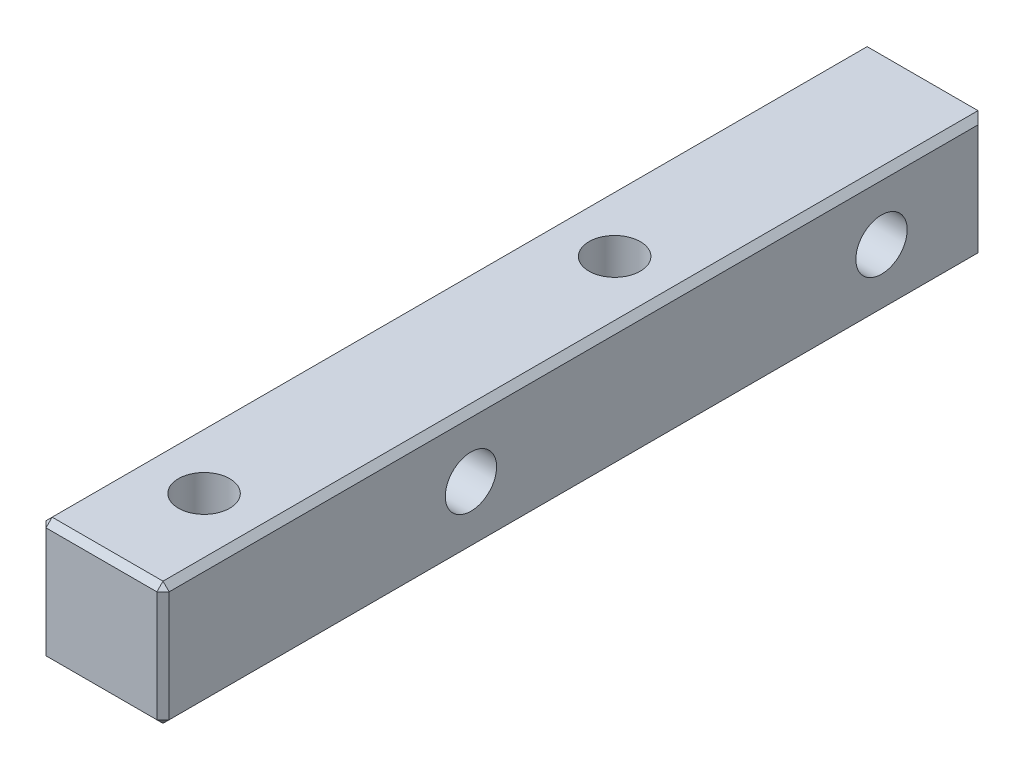
ISO-10303-21;
HEADER;
FILE_DESCRIPTION(('STEP AP214'),'2;1');
FILE_NAME('part.step','',(''),(''),'','','');
FILE_SCHEMA(('AUTOMOTIVE_DESIGN { 1 0 10303 214 1 1 1 1 }'));
ENDSEC;
DATA;
#1=APPLICATION_CONTEXT('core data for automotive mechanical design processes');
#2=APPLICATION_PROTOCOL_DEFINITION('international standard','automotive_design',2000,#1);
#3=PRODUCT_CONTEXT('',#1,'mechanical');
#4=PRODUCT('Part','Part','',(#3));
#5=PRODUCT_RELATED_PRODUCT_CATEGORY('part','',(#4));
#6=PRODUCT_DEFINITION_FORMATION('','',#4);
#7=PRODUCT_DEFINITION_CONTEXT('part definition',#1,'design');
#8=PRODUCT_DEFINITION('design','',#6,#7);
#9=PRODUCT_DEFINITION_SHAPE('','',#8);
#10=(LENGTH_UNIT() NAMED_UNIT(*) SI_UNIT(.MILLI.,.METRE.));
#11=(NAMED_UNIT(*) PLANE_ANGLE_UNIT() SI_UNIT($,.RADIAN.));
#12=(NAMED_UNIT(*) SI_UNIT($,.STERADIAN.) SOLID_ANGLE_UNIT());
#13=UNCERTAINTY_MEASURE_WITH_UNIT(LENGTH_MEASURE(1.E-05),#10,'distance_accuracy_value','');
#14=(GEOMETRIC_REPRESENTATION_CONTEXT(3) GLOBAL_UNCERTAINTY_ASSIGNED_CONTEXT((#13)) GLOBAL_UNIT_ASSIGNED_CONTEXT((#10,
#11,#12)) REPRESENTATION_CONTEXT('',''));
#15=CARTESIAN_POINT('',(0.,0.,0.));
#16=DIRECTION('',(0.,0.,1.));
#17=DIRECTION('',(1.,0.,0.));
#18=AXIS2_PLACEMENT_3D('',#15,#16,#17);
#19=CARTESIAN_POINT('',(3.,-3.,20.));
#20=DIRECTION('',(-1.,0.,0.));
#21=DIRECTION('',(0.,-1.,0.));
#22=AXIS2_PLACEMENT_3D('',#19,#20,#21);
#23=PLANE('',#22);
#24=DIRECTION('',(0.,0.,1.));
#25=VECTOR('',#24,1.);
#26=CARTESIAN_POINT('',(3.,2.7,20.));
#27=LINE('',#26,#25);
#28=CARTESIAN_POINT('',(3.,2.7,-19.7));
#29=VERTEX_POINT('',#28);
#30=CARTESIAN_POINT('',(3.,2.7,19.7));
#31=VERTEX_POINT('',#30);
#32=EDGE_CURVE('E182',#29,#31,#27,.T.);
#33=ORIENTED_EDGE('',*,*,#32,.T.);
#34=DIRECTION('',(0.,-1.,0.));
#35=VECTOR('',#34,1.);
#36=CARTESIAN_POINT('',(3.,-3.,19.7));
#37=LINE('',#36,#35);
#38=CARTESIAN_POINT('',(3.,-2.7,19.7));
#39=VERTEX_POINT('',#38);
#40=EDGE_CURVE('E188',#31,#39,#37,.T.);
#41=ORIENTED_EDGE('',*,*,#40,.T.);
#42=DIRECTION('',(0.,0.,-1.));
#43=VECTOR('',#42,1.);
#44=CARTESIAN_POINT('',(3.,-2.7,20.));
#45=LINE('',#44,#43);
#46=CARTESIAN_POINT('',(3.,-2.7,-19.7));
#47=VERTEX_POINT('',#46);
#48=EDGE_CURVE('E186',#39,#47,#45,.T.);
#49=ORIENTED_EDGE('',*,*,#48,.T.);
#50=DIRECTION('',(0.,1.,0.));
#51=VECTOR('',#50,1.);
#52=CARTESIAN_POINT('',(3.,3.,-19.7));
#53=LINE('',#52,#51);
#54=EDGE_CURVE('E184',#47,#29,#53,.T.);
#55=ORIENTED_EDGE('',*,*,#54,.T.);
#56=EDGE_LOOP('',(#33,#41,#49,#55));
#57=FACE_BOUND('',#56,.T.);
#58=CARTESIAN_POINT('',(3.,0.,-15.));
#59=DIRECTION('',(-1.,0.,0.));
#60=DIRECTION('',(0.,-1.,0.));
#61=AXIS2_PLACEMENT_3D('',#58,#59,#60);
#62=CIRCLE('',#61,1.24999999999999);
#63=CARTESIAN_POINT('',(3.,-1.24999999999999,-15.));
#64=VERTEX_POINT('',#63);
#65=EDGE_CURVE('E266',#64,#64,#62,.T.);
#66=ORIENTED_EDGE('',*,*,#65,.T.);
#67=EDGE_LOOP('',(#66));
#68=FACE_BOUND('',#67,.T.);
#69=CARTESIAN_POINT('',(3.,0.,5.));
#70=DIRECTION('',(-1.,0.,0.));
#71=DIRECTION('',(0.,-1.,0.));
#72=AXIS2_PLACEMENT_3D('',#69,#70,#71);
#73=CIRCLE('',#72,1.24999999999999);
#74=CARTESIAN_POINT('',(3.,-1.24999999999999,5.));
#75=VERTEX_POINT('',#74);
#76=EDGE_CURVE('E272',#75,#75,#73,.T.);
#77=ORIENTED_EDGE('',*,*,#76,.T.);
#78=EDGE_LOOP('',(#77));
#79=FACE_BOUND('',#78,.T.);
#80=ADVANCED_FACE('F42',(#57,#68,#79),#23,.F.);
#81=CARTESIAN_POINT('',(-3.,3.,20.));
#82=DIRECTION('',(0.,-1.,0.));
#83=DIRECTION('',(1.,0.,0.));
#84=AXIS2_PLACEMENT_3D('',#81,#82,#83);
#85=PLANE('',#84);
#86=CARTESIAN_POINT('',(0.,3.,-5.));
#87=DIRECTION('',(0.,1.,0.));
#88=DIRECTION('',(0.,0.,1.));
#89=AXIS2_PLACEMENT_3D('',#86,#87,#88);
#90=CIRCLE('',#89,1.24999999999999);
#91=CARTESIAN_POINT('',(0.,3.,-3.75000000000001));
#92=VERTEX_POINT('',#91);
#93=EDGE_CURVE('E244',#92,#92,#90,.T.);
#94=ORIENTED_EDGE('',*,*,#93,.F.);
#95=EDGE_LOOP('',(#94));
#96=FACE_BOUND('',#95,.T.);
#97=CARTESIAN_POINT('',(0.,3.,15.));
#98=DIRECTION('',(0.,1.,0.));
#99=DIRECTION('',(0.,0.,1.));
#100=AXIS2_PLACEMENT_3D('',#97,#98,#99);
#101=CIRCLE('',#100,1.24999999999999);
#102=CARTESIAN_POINT('',(0.,3.,16.25));
#103=VERTEX_POINT('',#102);
#104=EDGE_CURVE('E255',#103,#103,#101,.T.);
#105=ORIENTED_EDGE('',*,*,#104,.F.);
#106=EDGE_LOOP('',(#105));
#107=FACE_BOUND('',#106,.T.);
#108=DIRECTION('',(1.,0.,0.));
#109=VECTOR('',#108,1.);
#110=CARTESIAN_POINT('',(-3.,3.,19.7));
#111=LINE('',#110,#109);
#112=CARTESIAN_POINT('',(-2.7,3.,19.7));
#113=VERTEX_POINT('',#112);
#114=CARTESIAN_POINT('',(2.7,3.,19.7));
#115=VERTEX_POINT('',#114);
#116=EDGE_CURVE('E52',#113,#115,#111,.T.);
#117=ORIENTED_EDGE('',*,*,#116,.T.);
#118=DIRECTION('',(0.,0.,-1.));
#119=VECTOR('',#118,1.);
#120=CARTESIAN_POINT('',(2.7,3.,20.));
#121=LINE('',#120,#119);
#122=CARTESIAN_POINT('',(2.7,3.,-20.));
#123=VERTEX_POINT('',#122);
#124=EDGE_CURVE('E11',#115,#123,#121,.T.);
#125=ORIENTED_EDGE('',*,*,#124,.T.);
#126=DIRECTION('',(-1.,0.,0.));
#127=VECTOR('',#126,1.);
#128=CARTESIAN_POINT('',(-3.,3.,-20.));
#129=LINE('',#128,#127);
#130=CARTESIAN_POINT('',(-2.7,3.,-20.));
#131=VERTEX_POINT('',#130);
#132=EDGE_CURVE('E155',#123,#131,#129,.T.);
#133=ORIENTED_EDGE('',*,*,#132,.T.);
#134=DIRECTION('',(0.,0.,1.));
#135=VECTOR('',#134,1.);
#136=CARTESIAN_POINT('',(-2.7,3.,20.));
#137=LINE('',#136,#135);
#138=EDGE_CURVE('E63',#131,#113,#137,.T.);
#139=ORIENTED_EDGE('',*,*,#138,.T.);
#140=EDGE_LOOP('',(#117,#125,#133,#139));
#141=FACE_BOUND('',#140,.T.);
#142=ADVANCED_FACE('F276',(#96,#107,#141),#85,.F.);
#143=CARTESIAN_POINT('',(-3.,-3.,20.));
#144=DIRECTION('',(1.,0.,0.));
#145=DIRECTION('',(0.,0.,-1.));
#146=AXIS2_PLACEMENT_3D('',#143,#144,#145);
#147=PLANE('',#146);
#148=DIRECTION('',(0.,-1.,0.));
#149=VECTOR('',#148,1.);
#150=CARTESIAN_POINT('',(-3.,-3.,-19.7));
#151=LINE('',#150,#149);
#152=CARTESIAN_POINT('',(-3.,2.7,-19.7));
#153=VERTEX_POINT('',#152);
#154=CARTESIAN_POINT('',(-3.,-2.7,-19.7));
#155=VERTEX_POINT('',#154);
#156=EDGE_CURVE('E170',#153,#155,#151,.T.);
#157=ORIENTED_EDGE('',*,*,#156,.T.);
#158=DIRECTION('',(0.,0.,1.));
#159=VECTOR('',#158,1.);
#160=CARTESIAN_POINT('',(-3.,-2.7,20.));
#161=LINE('',#160,#159);
#162=CARTESIAN_POINT('',(-3.,-2.7,19.7));
#163=VERTEX_POINT('',#162);
#164=EDGE_CURVE('E132',#155,#163,#161,.T.);
#165=ORIENTED_EDGE('',*,*,#164,.T.);
#166=DIRECTION('',(0.,1.,0.));
#167=VECTOR('',#166,1.);
#168=CARTESIAN_POINT('',(-3.,-3.,19.7));
#169=LINE('',#168,#167);
#170=CARTESIAN_POINT('',(-3.,2.7,19.7));
#171=VERTEX_POINT('',#170);
#172=EDGE_CURVE('E168',#163,#171,#169,.T.);
#173=ORIENTED_EDGE('',*,*,#172,.T.);
#174=DIRECTION('',(0.,0.,-1.));
#175=VECTOR('',#174,1.);
#176=CARTESIAN_POINT('',(-3.,2.7,20.));
#177=LINE('',#176,#175);
#178=EDGE_CURVE('E163',#171,#153,#177,.T.);
#179=ORIENTED_EDGE('',*,*,#178,.T.);
#180=EDGE_LOOP('',(#157,#165,#173,#179));
#181=FACE_BOUND('',#180,.T.);
#182=CARTESIAN_POINT('',(-3.,0.,-15.));
#183=DIRECTION('',(-1.,0.,0.));
#184=DIRECTION('',(0.,0.,1.));
#185=AXIS2_PLACEMENT_3D('',#182,#183,#184);
#186=CIRCLE('',#185,1.24999999999999);
#187=CARTESIAN_POINT('',(-3.,0.,-13.75));
#188=VERTEX_POINT('',#187);
#189=EDGE_CURVE('E263',#188,#188,#186,.T.);
#190=ORIENTED_EDGE('',*,*,#189,.F.);
#191=EDGE_LOOP('',(#190));
#192=FACE_BOUND('',#191,.T.);
#193=CARTESIAN_POINT('',(-3.,0.,5.));
#194=DIRECTION('',(-1.,0.,0.));
#195=DIRECTION('',(0.,0.,1.));
#196=AXIS2_PLACEMENT_3D('',#193,#194,#195);
#197=CIRCLE('',#196,1.24999999999999);
#198=CARTESIAN_POINT('',(-3.,0.,6.24999999999999));
#199=VERTEX_POINT('',#198);
#200=EDGE_CURVE('E269',#199,#199,#197,.T.);
#201=ORIENTED_EDGE('',*,*,#200,.F.);
#202=EDGE_LOOP('',(#201));
#203=FACE_BOUND('',#202,.T.);
#204=ADVANCED_FACE('F288',(#181,#192,#203),#147,.F.);
#205=CARTESIAN_POINT('',(-3.,-3.,20.));
#206=DIRECTION('',(0.,1.,0.));
#207=DIRECTION('',(0.,0.,1.));
#208=AXIS2_PLACEMENT_3D('',#205,#206,#207);
#209=PLANE('',#208);
#210=DIRECTION('',(0.,0.,1.));
#211=VECTOR('',#210,1.);
#212=CARTESIAN_POINT('',(2.7,-3.,20.));
#213=LINE('',#212,#211);
#214=CARTESIAN_POINT('',(2.7,-3.,-19.7));
#215=VERTEX_POINT('',#214);
#216=CARTESIAN_POINT('',(2.7,-3.,19.7));
#217=VERTEX_POINT('',#216);
#218=EDGE_CURVE('E154',#215,#217,#213,.T.);
#219=ORIENTED_EDGE('',*,*,#218,.T.);
#220=DIRECTION('',(-1.,0.,0.));
#221=VECTOR('',#220,1.);
#222=CARTESIAN_POINT('',(-3.,-3.,19.7));
#223=LINE('',#222,#221);
#224=CARTESIAN_POINT('',(-2.7,-3.,19.7));
#225=VERTEX_POINT('',#224);
#226=EDGE_CURVE('E160',#217,#225,#223,.T.);
#227=ORIENTED_EDGE('',*,*,#226,.T.);
#228=DIRECTION('',(0.,0.,-1.));
#229=VECTOR('',#228,1.);
#230=CARTESIAN_POINT('',(-2.7,-3.,20.));
#231=LINE('',#230,#229);
#232=CARTESIAN_POINT('',(-2.7,-3.,-19.7));
#233=VERTEX_POINT('',#232);
#234=EDGE_CURVE('E130',#225,#233,#231,.T.);
#235=ORIENTED_EDGE('',*,*,#234,.T.);
#236=DIRECTION('',(1.,0.,0.));
#237=VECTOR('',#236,1.);
#238=CARTESIAN_POINT('',(3.,-3.,-19.7));
#239=LINE('',#238,#237);
#240=EDGE_CURVE('E148',#233,#215,#239,.T.);
#241=ORIENTED_EDGE('',*,*,#240,.T.);
#242=EDGE_LOOP('',(#219,#227,#235,#241));
#243=FACE_BOUND('',#242,.T.);
#244=CARTESIAN_POINT('',(0.,-3.,-5.));
#245=DIRECTION('',(0.,1.,0.));
#246=DIRECTION('',(0.,0.,1.));
#247=AXIS2_PLACEMENT_3D('',#244,#245,#246);
#248=CIRCLE('',#247,1.24999999999999);
#249=CARTESIAN_POINT('',(0.,-3.,-3.75000000000001));
#250=VERTEX_POINT('',#249);
#251=EDGE_CURVE('E250',#250,#250,#248,.T.);
#252=ORIENTED_EDGE('',*,*,#251,.T.);
#253=EDGE_LOOP('',(#252));
#254=FACE_BOUND('',#253,.T.);
#255=CARTESIAN_POINT('',(0.,-3.,15.));
#256=DIRECTION('',(0.,1.,0.));
#257=DIRECTION('',(0.,0.,1.));
#258=AXIS2_PLACEMENT_3D('',#255,#256,#257);
#259=CIRCLE('',#258,1.24999999999999);
#260=CARTESIAN_POINT('',(0.,-3.,16.25));
#261=VERTEX_POINT('',#260);
#262=EDGE_CURVE('E260',#261,#261,#259,.T.);
#263=ORIENTED_EDGE('',*,*,#262,.T.);
#264=EDGE_LOOP('',(#263));
#265=FACE_BOUND('',#264,.T.);
#266=ADVANCED_FACE('F157',(#243,#254,#265),#209,.F.);
#267=CARTESIAN_POINT('',(0.,0.,20.));
#268=DIRECTION('',(0.,0.,-1.));
#269=DIRECTION('',(-1.,0.,0.));
#270=AXIS2_PLACEMENT_3D('',#267,#268,#269);
#271=PLANE('',#270);
#272=DIRECTION('',(1.,0.,0.));
#273=VECTOR('',#272,1.);
#274=CARTESIAN_POINT('',(0.,-2.7,20.));
#275=LINE('',#274,#273);
#276=CARTESIAN_POINT('',(-2.7,-2.7,20.));
#277=VERTEX_POINT('',#276);
#278=CARTESIAN_POINT('',(2.7,-2.7,20.));
#279=VERTEX_POINT('',#278);
#280=EDGE_CURVE('E177',#277,#279,#275,.T.);
#281=ORIENTED_EDGE('',*,*,#280,.T.);
#282=DIRECTION('',(0.,1.,0.));
#283=VECTOR('',#282,1.);
#284=CARTESIAN_POINT('',(2.7,0.,20.));
#285=LINE('',#284,#283);
#286=CARTESIAN_POINT('',(2.7,2.7,20.));
#287=VERTEX_POINT('',#286);
#288=EDGE_CURVE('E179',#279,#287,#285,.T.);
#289=ORIENTED_EDGE('',*,*,#288,.T.);
#290=DIRECTION('',(-1.,0.,0.));
#291=VECTOR('',#290,1.);
#292=CARTESIAN_POINT('',(0.,2.7,20.));
#293=LINE('',#292,#291);
#294=CARTESIAN_POINT('',(-2.7,2.7,20.));
#295=VERTEX_POINT('',#294);
#296=EDGE_CURVE('E175',#287,#295,#293,.T.);
#297=ORIENTED_EDGE('',*,*,#296,.T.);
#298=DIRECTION('',(0.,-1.,0.));
#299=VECTOR('',#298,1.);
#300=CARTESIAN_POINT('',(-2.7,0.,20.));
#301=LINE('',#300,#299);
#302=EDGE_CURVE('E173',#295,#277,#301,.T.);
#303=ORIENTED_EDGE('',*,*,#302,.T.);
#304=EDGE_LOOP('',(#281,#289,#297,#303));
#305=FACE_BOUND('',#304,.T.);
#306=ADVANCED_FACE('F307',(#305),#271,.F.);
#307=CARTESIAN_POINT('',(0.,0.,-20.));
#308=DIRECTION('',(0.,0.,-1.));
#309=DIRECTION('',(-1.,0.,0.));
#310=AXIS2_PLACEMENT_3D('',#307,#308,#309);
#311=PLANE('',#310);
#312=DIRECTION('',(-1.,0.,0.));
#313=VECTOR('',#312,1.);
#314=CARTESIAN_POINT('',(-3.,-2.7,-20.));
#315=LINE('',#314,#313);
#316=CARTESIAN_POINT('',(2.7,-2.7,-20.));
#317=VERTEX_POINT('',#316);
#318=CARTESIAN_POINT('',(-2.7,-2.7,-20.));
#319=VERTEX_POINT('',#318);
#320=EDGE_CURVE('E193',#317,#319,#315,.T.);
#321=ORIENTED_EDGE('',*,*,#320,.T.);
#322=DIRECTION('',(0.,1.,0.));
#323=VECTOR('',#322,1.);
#324=CARTESIAN_POINT('',(-2.7,3.,-20.));
#325=LINE('',#324,#323);
#326=EDGE_CURVE('E196',#319,#131,#325,.T.);
#327=ORIENTED_EDGE('',*,*,#326,.T.);
#328=ORIENTED_EDGE('',*,*,#132,.F.);
#329=DIRECTION('',(0.,-1.,0.));
#330=VECTOR('',#329,1.);
#331=CARTESIAN_POINT('',(2.7,-3.,-20.));
#332=LINE('',#331,#330);
#333=EDGE_CURVE('E191',#123,#317,#332,.T.);
#334=ORIENTED_EDGE('',*,*,#333,.T.);
#335=EDGE_LOOP('',(#321,#327,#328,#334));
#336=FACE_BOUND('',#335,.T.);
#337=ADVANCED_FACE('F427',(#336),#311,.T.);
#338=CARTESIAN_POINT('',(-3.,0.,5.));
#339=DIRECTION('',(-1.,0.,0.));
#340=DIRECTION('',(0.,0.,1.));
#341=AXIS2_PLACEMENT_3D('',#338,#339,#340);
#342=CYLINDRICAL_SURFACE('',#341,1.24999999999999);
#343=ORIENTED_EDGE('',*,*,#76,.F.);
#344=EDGE_LOOP('',(#343));
#345=FACE_BOUND('',#344,.T.);
#346=ORIENTED_EDGE('',*,*,#200,.T.);
#347=EDGE_LOOP('',(#346));
#348=FACE_BOUND('',#347,.T.);
#349=ADVANCED_FACE('F423',(#345,#348),#342,.F.);
#350=CARTESIAN_POINT('',(-3.,0.,-15.));
#351=DIRECTION('',(-1.,0.,0.));
#352=DIRECTION('',(0.,0.,1.));
#353=AXIS2_PLACEMENT_3D('',#350,#351,#352);
#354=CYLINDRICAL_SURFACE('',#353,1.24999999999999);
#355=ORIENTED_EDGE('',*,*,#65,.F.);
#356=EDGE_LOOP('',(#355));
#357=FACE_BOUND('',#356,.T.);
#358=ORIENTED_EDGE('',*,*,#189,.T.);
#359=EDGE_LOOP('',(#358));
#360=FACE_BOUND('',#359,.T.);
#361=ADVANCED_FACE('F416',(#357,#360),#354,.F.);
#362=CARTESIAN_POINT('',(0.,3.,15.));
#363=DIRECTION('',(0.,1.,0.));
#364=DIRECTION('',(0.,0.,1.));
#365=AXIS2_PLACEMENT_3D('',#362,#363,#364);
#366=CYLINDRICAL_SURFACE('',#365,1.24999999999999);
#367=ORIENTED_EDGE('',*,*,#262,.F.);
#368=EDGE_LOOP('',(#367));
#369=FACE_BOUND('',#368,.T.);
#370=ORIENTED_EDGE('',*,*,#104,.T.);
#371=EDGE_LOOP('',(#370));
#372=FACE_BOUND('',#371,.T.);
#373=ADVANCED_FACE('F410',(#369,#372),#366,.F.);
#374=CARTESIAN_POINT('',(0.,3.,-5.));
#375=DIRECTION('',(0.,1.,0.));
#376=DIRECTION('',(0.,0.,1.));
#377=AXIS2_PLACEMENT_3D('',#374,#375,#376);
#378=CYLINDRICAL_SURFACE('',#377,1.24999999999999);
#379=ORIENTED_EDGE('',*,*,#251,.F.);
#380=EDGE_LOOP('',(#379));
#381=FACE_BOUND('',#380,.T.);
#382=ORIENTED_EDGE('',*,*,#93,.T.);
#383=EDGE_LOOP('',(#382));
#384=FACE_BOUND('',#383,.T.);
#385=ADVANCED_FACE('F406',(#381,#384),#378,.F.);
#386=CARTESIAN_POINT('',(2.7,2.7,20.));
#387=DIRECTION('',(0.577350269189626,0.577350269189626,0.577350269189626));
#388=DIRECTION('',(0.707106781186547,0.,-0.707106781186547));
#389=AXIS2_PLACEMENT_3D('',#386,#387,#388);
#390=PLANE('',#389);
#391=DIRECTION('',(-0.707106781186547,0.,0.707106781186547));
#392=VECTOR('',#391,1.);
#393=CARTESIAN_POINT('',(2.7,2.7,20.));
#394=LINE('',#393,#392);
#395=EDGE_CURVE('E237',#31,#287,#394,.T.);
#396=ORIENTED_EDGE('',*,*,#395,.F.);
#397=DIRECTION('',(0.707106781186547,-0.707106781186547,0.));
#398=VECTOR('',#397,1.);
#399=CARTESIAN_POINT('',(2.85,2.85,19.7));
#400=LINE('',#399,#398);
#401=EDGE_CURVE('E47',#115,#31,#400,.T.);
#402=ORIENTED_EDGE('',*,*,#401,.F.);
#403=DIRECTION('',(0.,0.707106781186547,-0.707106781186547));
#404=VECTOR('',#403,1.);
#405=CARTESIAN_POINT('',(2.7,2.7,20.));
#406=LINE('',#405,#404);
#407=EDGE_CURVE('E239',#287,#115,#406,.T.);
#408=ORIENTED_EDGE('',*,*,#407,.F.);
#409=EDGE_LOOP('',(#396,#402,#408));
#410=FACE_BOUND('',#409,.T.);
#411=ADVANCED_FACE('F45',(#410),#390,.T.);
#412=CARTESIAN_POINT('',(2.7,3.,20.));
#413=DIRECTION('',(-0.707106781186547,-0.707106781186547,0.));
#414=DIRECTION('',(0.,0.,-1.));
#415=AXIS2_PLACEMENT_3D('',#412,#413,#414);
#416=PLANE('',#415);
#417=ORIENTED_EDGE('',*,*,#401,.T.);
#418=ORIENTED_EDGE('',*,*,#32,.F.);
#419=DIRECTION('',(0.577350269189624,-0.577350269189624,0.57735026918963));
#420=VECTOR('',#419,1.);
#421=CARTESIAN_POINT('',(16.0333333333334,-10.3333333333334,-6.66666666666647));
#422=LINE('',#421,#420);
#423=EDGE_CURVE('E234',#123,#29,#422,.T.);
#424=ORIENTED_EDGE('',*,*,#423,.F.);
#425=ORIENTED_EDGE('',*,*,#124,.F.);
#426=EDGE_LOOP('',(#417,#418,#424,#425));
#427=FACE_BOUND('',#426,.T.);
#428=ADVANCED_FACE('F398',(#427),#416,.F.);
#429=CARTESIAN_POINT('',(0.,2.7,20.));
#430=DIRECTION('',(0.,-0.707106781186547,-0.707106781186547));
#431=DIRECTION('',(-1.,0.,0.));
#432=AXIS2_PLACEMENT_3D('',#429,#430,#431);
#433=PLANE('',#432);
#434=ORIENTED_EDGE('',*,*,#407,.T.);
#435=ORIENTED_EDGE('',*,*,#116,.F.);
#436=DIRECTION('',(0.,-0.707106781186548,0.707106781186548));
#437=VECTOR('',#436,1.);
#438=CARTESIAN_POINT('',(-2.7,2.7,20.));
#439=LINE('',#438,#437);
#440=EDGE_CURVE('E231',#295,#113,#439,.F.);
#441=ORIENTED_EDGE('',*,*,#440,.F.);
#442=ORIENTED_EDGE('',*,*,#296,.F.);
#443=EDGE_LOOP('',(#434,#435,#441,#442));
#444=FACE_BOUND('',#443,.T.);
#445=ADVANCED_FACE('F299',(#444),#433,.F.);
#446=CARTESIAN_POINT('',(2.7,0.,20.));
#447=DIRECTION('',(-0.707106781186547,0.,-0.707106781186547));
#448=DIRECTION('',(0.,1.,0.));
#449=AXIS2_PLACEMENT_3D('',#446,#447,#448);
#450=PLANE('',#449);
#451=ORIENTED_EDGE('',*,*,#395,.T.);
#452=ORIENTED_EDGE('',*,*,#288,.F.);
#453=DIRECTION('',(0.707106781186548,0.,-0.707106781186548));
#454=VECTOR('',#453,1.);
#455=CARTESIAN_POINT('',(3.,-2.7,19.7));
#456=LINE('',#455,#454);
#457=EDGE_CURVE('E228',#39,#279,#456,.F.);
#458=ORIENTED_EDGE('',*,*,#457,.F.);
#459=ORIENTED_EDGE('',*,*,#40,.F.);
#460=EDGE_LOOP('',(#451,#452,#458,#459));
#461=FACE_BOUND('',#460,.T.);
#462=ADVANCED_FACE('F305',(#461),#450,.F.);
#463=CARTESIAN_POINT('',(3.,-2.7,20.));
#464=DIRECTION('',(-0.707106781186547,0.707106781186547,0.));
#465=DIRECTION('',(0.,0.,-1.));
#466=AXIS2_PLACEMENT_3D('',#463,#464,#465);
#467=PLANE('',#466);
#468=DIRECTION('',(0.707106781186548,0.707106781186548,0.));
#469=VECTOR('',#468,1.);
#470=CARTESIAN_POINT('',(3.,-2.7,-19.7));
#471=LINE('',#470,#469);
#472=EDGE_CURVE('E223',#47,#215,#471,.F.);
#473=ORIENTED_EDGE('',*,*,#472,.F.);
#474=ORIENTED_EDGE('',*,*,#48,.F.);
#475=DIRECTION('',(-0.707106781186547,-0.707106781186547,0.));
#476=VECTOR('',#475,1.);
#477=CARTESIAN_POINT('',(3.,-2.7,19.7));
#478=LINE('',#477,#476);
#479=EDGE_CURVE('E226',#217,#39,#478,.F.);
#480=ORIENTED_EDGE('',*,*,#479,.F.);
#481=ORIENTED_EDGE('',*,*,#218,.F.);
#482=EDGE_LOOP('',(#473,#474,#480,#481));
#483=FACE_BOUND('',#482,.T.);
#484=ADVANCED_FACE('F387',(#483),#467,.F.);
#485=CARTESIAN_POINT('',(3.,-3.,-19.7));
#486=DIRECTION('',(0.707106781186552,0.,-0.707106781186543));
#487=DIRECTION('',(0.,-1.,0.));
#488=AXIS2_PLACEMENT_3D('',#485,#486,#487);
#489=PLANE('',#488);
#490=ORIENTED_EDGE('',*,*,#423,.T.);
#491=ORIENTED_EDGE('',*,*,#54,.F.);
#492=DIRECTION('',(0.707106781186543,0.,0.707106781186552));
#493=VECTOR('',#492,1.);
#494=CARTESIAN_POINT('',(3.,-2.7,-19.7));
#495=LINE('',#494,#493);
#496=EDGE_CURVE('E220',#317,#47,#495,.T.);
#497=ORIENTED_EDGE('',*,*,#496,.F.);
#498=ORIENTED_EDGE('',*,*,#333,.F.);
#499=EDGE_LOOP('',(#490,#491,#497,#498));
#500=FACE_BOUND('',#499,.T.);
#501=ADVANCED_FACE('F382',(#500),#489,.T.);
#502=CARTESIAN_POINT('',(-2.7,2.7,20.));
#503=DIRECTION('',(-0.577350269189626,0.577350269189626,0.577350269189626));
#504=DIRECTION('',(0.707106781186547,0.,0.707106781186547));
#505=AXIS2_PLACEMENT_3D('',#502,#503,#504);
#506=PLANE('',#505);
#507=DIRECTION('',(-0.707106781186547,0.,-0.707106781186547));
#508=VECTOR('',#507,1.);
#509=CARTESIAN_POINT('',(-2.7,2.7,20.));
#510=LINE('',#509,#508);
#511=EDGE_CURVE('E214',#295,#171,#510,.T.);
#512=ORIENTED_EDGE('',*,*,#511,.F.);
#513=ORIENTED_EDGE('',*,*,#440,.T.);
#514=DIRECTION('',(0.707106781186547,0.707106781186547,0.));
#515=VECTOR('',#514,1.);
#516=CARTESIAN_POINT('',(-2.85,2.85,19.7));
#517=LINE('',#516,#515);
#518=EDGE_CURVE('E217',#171,#113,#517,.T.);
#519=ORIENTED_EDGE('',*,*,#518,.F.);
#520=EDGE_LOOP('',(#512,#513,#519));
#521=FACE_BOUND('',#520,.T.);
#522=ADVANCED_FACE('F297',(#521),#506,.T.);
#523=CARTESIAN_POINT('',(3.,-2.7,19.7));
#524=DIRECTION('',(0.577350269189626,-0.577350269189626,0.577350269189626));
#525=DIRECTION('',(0.707106781186547,0.,-0.707106781186547));
#526=AXIS2_PLACEMENT_3D('',#523,#524,#525);
#527=PLANE('',#526);
#528=ORIENTED_EDGE('',*,*,#479,.T.);
#529=ORIENTED_EDGE('',*,*,#457,.T.);
#530=DIRECTION('',(0.,0.707106781186547,0.707106781186547));
#531=VECTOR('',#530,1.);
#532=CARTESIAN_POINT('',(2.7,-2.85,19.85));
#533=LINE('',#532,#531);
#534=EDGE_CURVE('E211',#217,#279,#533,.T.);
#535=ORIENTED_EDGE('',*,*,#534,.F.);
#536=EDGE_LOOP('',(#528,#529,#535));
#537=FACE_BOUND('',#536,.T.);
#538=ADVANCED_FACE('F373',(#537),#527,.T.);
#539=CARTESIAN_POINT('',(3.,-2.7,-19.7));
#540=DIRECTION('',(0.577350269189628,-0.577350269189628,-0.577350269189621));
#541=DIRECTION('',(0.707106781186547,0.707106781186547,0.));
#542=AXIS2_PLACEMENT_3D('',#539,#540,#541);
#543=PLANE('',#542);
#544=ORIENTED_EDGE('',*,*,#496,.T.);
#545=ORIENTED_EDGE('',*,*,#472,.T.);
#546=DIRECTION('',(0.,0.707106781186543,-0.707106781186552));
#547=VECTOR('',#546,1.);
#548=CARTESIAN_POINT('',(2.7,-2.85,-19.85));
#549=LINE('',#548,#547);
#550=EDGE_CURVE('E151',#317,#215,#549,.F.);
#551=ORIENTED_EDGE('',*,*,#550,.F.);
#552=EDGE_LOOP('',(#544,#545,#551));
#553=FACE_BOUND('',#552,.T.);
#554=ADVANCED_FACE('F368',(#553),#543,.T.);
#555=CARTESIAN_POINT('',(-3.,2.7,20.));
#556=DIRECTION('',(0.707106781186547,-0.707106781186547,0.));
#557=DIRECTION('',(0.,0.,-1.));
#558=AXIS2_PLACEMENT_3D('',#555,#556,#557);
#559=PLANE('',#558);
#560=ORIENTED_EDGE('',*,*,#518,.T.);
#561=ORIENTED_EDGE('',*,*,#138,.F.);
#562=DIRECTION('',(0.577350269189624,0.577350269189624,-0.57735026918963));
#563=VECTOR('',#562,1.);
#564=CARTESIAN_POINT('',(-16.2333333333334,-10.5333333333334,-6.46666666666646));
#565=LINE('',#564,#563);
#566=EDGE_CURVE('E207',#153,#131,#565,.T.);
#567=ORIENTED_EDGE('',*,*,#566,.F.);
#568=ORIENTED_EDGE('',*,*,#178,.F.);
#569=EDGE_LOOP('',(#560,#561,#567,#568));
#570=FACE_BOUND('',#569,.T.);
#571=ADVANCED_FACE('F281',(#570),#559,.F.);
#572=CARTESIAN_POINT('',(-2.7,0.,20.));
#573=DIRECTION('',(0.707106781186547,0.,-0.707106781186547));
#574=DIRECTION('',(0.,-1.,0.));
#575=AXIS2_PLACEMENT_3D('',#572,#573,#574);
#576=PLANE('',#575);
#577=ORIENTED_EDGE('',*,*,#511,.T.);
#578=ORIENTED_EDGE('',*,*,#172,.F.);
#579=DIRECTION('',(0.707106781186547,0.,0.707106781186547));
#580=VECTOR('',#579,1.);
#581=CARTESIAN_POINT('',(-3.,-2.7,19.7));
#582=LINE('',#581,#580);
#583=EDGE_CURVE('E204',#277,#163,#582,.F.);
#584=ORIENTED_EDGE('',*,*,#583,.F.);
#585=ORIENTED_EDGE('',*,*,#302,.F.);
#586=EDGE_LOOP('',(#577,#578,#584,#585));
#587=FACE_BOUND('',#586,.T.);
#588=ADVANCED_FACE('F295',(#587),#576,.F.);
#589=CARTESIAN_POINT('',(0.,-2.7,20.));
#590=DIRECTION('',(0.,0.707106781186547,-0.707106781186547));
#591=DIRECTION('',(1.,0.,0.));
#592=AXIS2_PLACEMENT_3D('',#589,#590,#591);
#593=PLANE('',#592);
#594=ORIENTED_EDGE('',*,*,#534,.T.);
#595=ORIENTED_EDGE('',*,*,#280,.F.);
#596=DIRECTION('',(0.,-0.707106781186547,-0.707106781186547));
#597=VECTOR('',#596,1.);
#598=CARTESIAN_POINT('',(-2.7,-2.85,19.85));
#599=LINE('',#598,#597);
#600=EDGE_CURVE('E145',#225,#277,#599,.F.);
#601=ORIENTED_EDGE('',*,*,#600,.F.);
#602=ORIENTED_EDGE('',*,*,#226,.F.);
#603=EDGE_LOOP('',(#594,#595,#601,#602));
#604=FACE_BOUND('',#603,.T.);
#605=ADVANCED_FACE('F310',(#604),#593,.F.);
#606=CARTESIAN_POINT('',(-3.,-3.,-19.7));
#607=DIRECTION('',(0.,-0.707106781186552,-0.707106781186543));
#608=DIRECTION('',(-1.,0.,0.));
#609=AXIS2_PLACEMENT_3D('',#606,#607,#608);
#610=PLANE('',#609);
#611=ORIENTED_EDGE('',*,*,#550,.T.);
#612=ORIENTED_EDGE('',*,*,#240,.F.);
#613=DIRECTION('',(0.,-0.707106781186543,0.707106781186552));
#614=VECTOR('',#613,1.);
#615=CARTESIAN_POINT('',(-2.7,-3.,-19.7));
#616=LINE('',#615,#614);
#617=EDGE_CURVE('E137',#319,#233,#616,.T.);
#618=ORIENTED_EDGE('',*,*,#617,.F.);
#619=ORIENTED_EDGE('',*,*,#320,.F.);
#620=EDGE_LOOP('',(#611,#612,#618,#619));
#621=FACE_BOUND('',#620,.T.);
#622=ADVANCED_FACE('F149',(#621),#610,.T.);
#623=CARTESIAN_POINT('',(-3.,-3.,-19.7));
#624=DIRECTION('',(-0.707106781186552,0.,-0.707106781186543));
#625=DIRECTION('',(0.,1.,0.));
#626=AXIS2_PLACEMENT_3D('',#623,#624,#625);
#627=PLANE('',#626);
#628=ORIENTED_EDGE('',*,*,#566,.T.);
#629=ORIENTED_EDGE('',*,*,#326,.F.);
#630=DIRECTION('',(0.707106781186543,0.,-0.707106781186552));
#631=VECTOR('',#630,1.);
#632=CARTESIAN_POINT('',(-2.85,-2.7,-19.85));
#633=LINE('',#632,#631);
#634=EDGE_CURVE('E141',#155,#319,#633,.T.);
#635=ORIENTED_EDGE('',*,*,#634,.F.);
#636=ORIENTED_EDGE('',*,*,#156,.F.);
#637=EDGE_LOOP('',(#628,#629,#635,#636));
#638=FACE_BOUND('',#637,.T.);
#639=ADVANCED_FACE('F286',(#638),#627,.T.);
#640=CARTESIAN_POINT('',(-3.,-2.7,19.7));
#641=DIRECTION('',(-0.577350269189626,-0.577350269189626,0.577350269189626));
#642=DIRECTION('',(0.707106781186547,0.,0.707106781186547));
#643=AXIS2_PLACEMENT_3D('',#640,#641,#642);
#644=PLANE('',#643);
#645=ORIENTED_EDGE('',*,*,#600,.T.);
#646=ORIENTED_EDGE('',*,*,#583,.T.);
#647=DIRECTION('',(-0.707106781186547,0.707106781186547,0.));
#648=VECTOR('',#647,1.);
#649=CARTESIAN_POINT('',(-3.,-2.7,19.7));
#650=LINE('',#649,#648);
#651=EDGE_CURVE('E134',#225,#163,#650,.T.);
#652=ORIENTED_EDGE('',*,*,#651,.F.);
#653=EDGE_LOOP('',(#645,#646,#652));
#654=FACE_BOUND('',#653,.T.);
#655=ADVANCED_FACE('F314',(#654),#644,.T.);
#656=CARTESIAN_POINT('',(-2.7,-3.,-19.7));
#657=DIRECTION('',(-0.577350269189628,-0.577350269189628,-0.577350269189621));
#658=DIRECTION('',(0.707106781186547,-0.707106781186547,0.));
#659=AXIS2_PLACEMENT_3D('',#656,#657,#658);
#660=PLANE('',#659);
#661=ORIENTED_EDGE('',*,*,#634,.T.);
#662=ORIENTED_EDGE('',*,*,#617,.T.);
#663=DIRECTION('',(0.707106781186548,-0.707106781186548,0.));
#664=VECTOR('',#663,1.);
#665=CARTESIAN_POINT('',(-2.7,-3.,-19.7));
#666=LINE('',#665,#664);
#667=EDGE_CURVE('E126',#155,#233,#666,.T.);
#668=ORIENTED_EDGE('',*,*,#667,.F.);
#669=EDGE_LOOP('',(#661,#662,#668));
#670=FACE_BOUND('',#669,.T.);
#671=ADVANCED_FACE('F139',(#670),#660,.T.);
#672=CARTESIAN_POINT('',(-2.7,-3.,20.));
#673=DIRECTION('',(0.707106781186547,0.707106781186547,0.));
#674=DIRECTION('',(0.,0.,-1.));
#675=AXIS2_PLACEMENT_3D('',#672,#673,#674);
#676=PLANE('',#675);
#677=ORIENTED_EDGE('',*,*,#651,.T.);
#678=ORIENTED_EDGE('',*,*,#164,.F.);
#679=ORIENTED_EDGE('',*,*,#667,.T.);
#680=ORIENTED_EDGE('',*,*,#234,.F.);
#681=EDGE_LOOP('',(#677,#678,#679,#680));
#682=FACE_BOUND('',#681,.T.);
#683=ADVANCED_FACE('F128',(#682),#676,.F.);
#684=CLOSED_SHELL('',(#80,#142,#204,#266,#306,#337,#349,#361,#373,#385,#411,#428,#445,#462,#484,
#501,#522,#538,#554,#571,#588,#605,#622,#639,#655,#671,#683));
#685=MANIFOLD_SOLID_BREP('B2',#684);
#686=ADVANCED_BREP_SHAPE_REPRESENTATION('',(#18,#685),#14);
#687=SHAPE_DEFINITION_REPRESENTATION(#9,#686);
ENDSEC;
END-ISO-10303-21;
